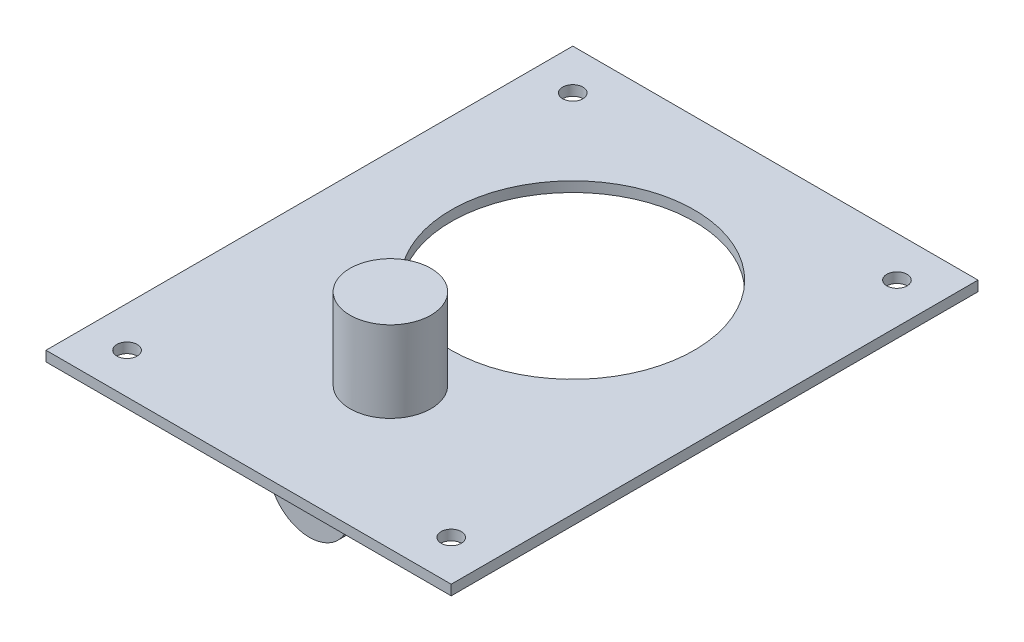
ISO-10303-21;
HEADER;
FILE_DESCRIPTION(('STEP AP214'),'2;1');
FILE_NAME('part.step','',(''),(''),'','','');
FILE_SCHEMA(('AUTOMOTIVE_DESIGN { 1 0 10303 214 1 1 1 1 }'));
ENDSEC;
DATA;
#1=APPLICATION_CONTEXT('core data for automotive mechanical design processes');
#2=APPLICATION_PROTOCOL_DEFINITION('international standard','automotive_design',2000,#1);
#3=PRODUCT_CONTEXT('',#1,'mechanical');
#4=PRODUCT('Part','Part','',(#3));
#5=PRODUCT_RELATED_PRODUCT_CATEGORY('part','',(#4));
#6=PRODUCT_DEFINITION_FORMATION('','',#4);
#7=PRODUCT_DEFINITION_CONTEXT('part definition',#1,'design');
#8=PRODUCT_DEFINITION('design','',#6,#7);
#9=PRODUCT_DEFINITION_SHAPE('','',#8);
#10=(LENGTH_UNIT() NAMED_UNIT(*) SI_UNIT(.MILLI.,.METRE.));
#11=(NAMED_UNIT(*) PLANE_ANGLE_UNIT() SI_UNIT($,.RADIAN.));
#12=(NAMED_UNIT(*) SI_UNIT($,.STERADIAN.) SOLID_ANGLE_UNIT());
#13=UNCERTAINTY_MEASURE_WITH_UNIT(LENGTH_MEASURE(1.E-05),#10,'distance_accuracy_value','');
#14=(GEOMETRIC_REPRESENTATION_CONTEXT(3) GLOBAL_UNCERTAINTY_ASSIGNED_CONTEXT((#13)) GLOBAL_UNIT_ASSIGNED_CONTEXT((#10,
#11,#12)) REPRESENTATION_CONTEXT('',''));
#15=CARTESIAN_POINT('',(0.,0.,0.));
#16=DIRECTION('',(0.,0.,1.));
#17=DIRECTION('',(1.,0.,0.));
#18=AXIS2_PLACEMENT_3D('',#15,#16,#17);
#19=CARTESIAN_POINT('',(0.,-28.575,165.1));
#20=DIRECTION('',(0.,0.,-1.));
#21=DIRECTION('',(-1.,0.,0.));
#22=AXIS2_PLACEMENT_3D('',#19,#20,#21);
#23=CYLINDRICAL_SURFACE('',#22,25.4);
#24=CARTESIAN_POINT('',(0.,-28.575,165.1));
#25=DIRECTION('',(0.,0.,1.));
#26=DIRECTION('',(1.,0.,0.));
#27=AXIS2_PLACEMENT_3D('',#24,#25,#26);
#28=CIRCLE('',#27,25.4);
#29=CARTESIAN_POINT('',(25.4,-28.575,165.1));
#30=VERTEX_POINT('',#29);
#31=EDGE_CURVE('E11',#30,#30,#28,.T.);
#32=ORIENTED_EDGE('',*,*,#31,.F.);
#33=EDGE_LOOP('',(#32));
#34=FACE_BOUND('',#33,.T.);
#35=CARTESIAN_POINT('',(0.,-28.575,114.3));
#36=DIRECTION('',(0.,0.,1.));
#37=DIRECTION('',(1.,0.,0.));
#38=AXIS2_PLACEMENT_3D('',#35,#36,#37);
#39=CIRCLE('',#38,25.4);
#40=CARTESIAN_POINT('',(25.4,-28.575,114.3));
#41=VERTEX_POINT('',#40);
#42=EDGE_CURVE('E48',#41,#41,#39,.T.);
#43=ORIENTED_EDGE('',*,*,#42,.T.);
#44=EDGE_LOOP('',(#43));
#45=FACE_BOUND('',#44,.T.);
#46=ADVANCED_FACE('F45',(#34,#45),#23,.T.);
#47=CARTESIAN_POINT('',(0.,-28.575,165.1));
#48=DIRECTION('',(0.,0.,1.));
#49=DIRECTION('',(1.,0.,0.));
#50=AXIS2_PLACEMENT_3D('',#47,#48,#49);
#51=PLANE('',#50);
#52=ORIENTED_EDGE('',*,*,#31,.T.);
#53=EDGE_LOOP('',(#52));
#54=FACE_BOUND('',#53,.T.);
#55=ADVANCED_FACE('F60',(#54),#51,.T.);
#56=CARTESIAN_POINT('',(0.,-28.575,114.3));
#57=DIRECTION('',(0.,0.,1.));
#58=DIRECTION('',(1.,0.,0.));
#59=AXIS2_PLACEMENT_3D('',#56,#57,#58);
#60=PLANE('',#59);
#61=ORIENTED_EDGE('',*,*,#42,.F.);
#62=EDGE_LOOP('',(#61));
#63=FACE_BOUND('',#62,.T.);
#64=ADVANCED_FACE('F58',(#63),#60,.F.);
#65=CLOSED_SHELL('',(#46,#55,#64));
#66=MANIFOLD_SOLID_BREP('B2',#65);
#67=CARTESIAN_POINT('',(0.,3.175,0.));
#68=DIRECTION('',(0.,-1.,0.));
#69=DIRECTION('',(0.,0.,-1.));
#70=AXIS2_PLACEMENT_3D('',#67,#68,#69);
#71=PLANE('',#70);
#72=CARTESIAN_POINT('',(101.6,3.175,-101.6));
#73=DIRECTION('',(0.,-1.,0.));
#74=DIRECTION('',(0.,0.,1.));
#75=AXIS2_PLACEMENT_3D('',#72,#73,#74);
#76=CIRCLE('',#75,6.34999999999999);
#77=CARTESIAN_POINT('',(101.6,3.175,-95.25));
#78=VERTEX_POINT('',#77);
#79=EDGE_CURVE('E199',#78,#78,#76,.T.);
#80=ORIENTED_EDGE('',*,*,#79,.T.);
#81=EDGE_LOOP('',(#80));
#82=FACE_BOUND('',#81,.T.);
#83=CARTESIAN_POINT('',(101.6,3.175,177.8));
#84=DIRECTION('',(0.,-1.,0.));
#85=DIRECTION('',(0.,0.,1.));
#86=AXIS2_PLACEMENT_3D('',#83,#84,#85);
#87=CIRCLE('',#86,6.34999999999999);
#88=CARTESIAN_POINT('',(101.6,3.175,184.15));
#89=VERTEX_POINT('',#88);
#90=EDGE_CURVE('E193',#89,#89,#87,.T.);
#91=ORIENTED_EDGE('',*,*,#90,.T.);
#92=EDGE_LOOP('',(#91));
#93=FACE_BOUND('',#92,.T.);
#94=CARTESIAN_POINT('',(-101.6,3.175,-101.6));
#95=DIRECTION('',(0.,1.,0.));
#96=DIRECTION('',(0.,0.,1.));
#97=AXIS2_PLACEMENT_3D('',#94,#95,#96);
#98=CIRCLE('',#97,6.34999999999999);
#99=CARTESIAN_POINT('',(-101.6,3.175,-95.25));
#100=VERTEX_POINT('',#99);
#101=EDGE_CURVE('E188',#100,#100,#98,.T.);
#102=ORIENTED_EDGE('',*,*,#101,.F.);
#103=EDGE_LOOP('',(#102));
#104=FACE_BOUND('',#103,.T.);
#105=CARTESIAN_POINT('',(-101.6,3.175,177.8));
#106=DIRECTION('',(0.,1.,0.));
#107=DIRECTION('',(0.,0.,1.));
#108=AXIS2_PLACEMENT_3D('',#105,#106,#107);
#109=CIRCLE('',#108,6.34999999999999);
#110=CARTESIAN_POINT('',(-101.6,3.175,184.15));
#111=VERTEX_POINT('',#110);
#112=EDGE_CURVE('E181',#111,#111,#109,.T.);
#113=ORIENTED_EDGE('',*,*,#112,.F.);
#114=EDGE_LOOP('',(#113));
#115=FACE_BOUND('',#114,.T.);
#116=CARTESIAN_POINT('',(0.,3.175,114.3));
#117=DIRECTION('',(0.,-1.,0.));
#118=DIRECTION('',(0.,0.,-1.));
#119=AXIS2_PLACEMENT_3D('',#116,#117,#118);
#120=CIRCLE('',#119,25.4);
#121=CARTESIAN_POINT('',(0.,3.175,88.9));
#122=VERTEX_POINT('',#121);
#123=EDGE_CURVE('E43',#122,#122,#120,.F.);
#124=ORIENTED_EDGE('',*,*,#123,.F.);
#125=EDGE_LOOP('',(#124));
#126=FACE_BOUND('',#125,.T.);
#127=DIRECTION('',(0.,0.,-1.));
#128=VECTOR('',#127,1.);
#129=CARTESIAN_POINT('',(127.,3.175,127.));
#130=LINE('',#129,#128);
#131=CARTESIAN_POINT('',(127.,3.175,203.2));
#132=VERTEX_POINT('',#131);
#133=CARTESIAN_POINT('',(127.,3.175,-127.));
#134=VERTEX_POINT('',#133);
#135=EDGE_CURVE('E103',#132,#134,#130,.T.);
#136=ORIENTED_EDGE('',*,*,#135,.T.);
#137=DIRECTION('',(-1.,0.,0.));
#138=VECTOR('',#137,1.);
#139=CARTESIAN_POINT('',(-127.,3.175,-127.));
#140=LINE('',#139,#138);
#141=CARTESIAN_POINT('',(-127.,3.175,-127.));
#142=VERTEX_POINT('',#141);
#143=EDGE_CURVE('E134',#134,#142,#140,.T.);
#144=ORIENTED_EDGE('',*,*,#143,.T.);
#145=DIRECTION('',(0.,0.,1.));
#146=VECTOR('',#145,1.);
#147=CARTESIAN_POINT('',(-127.,3.175,127.));
#148=LINE('',#147,#146);
#149=CARTESIAN_POINT('',(-127.,3.175,203.2));
#150=VERTEX_POINT('',#149);
#151=EDGE_CURVE('E138',#142,#150,#148,.T.);
#152=ORIENTED_EDGE('',*,*,#151,.T.);
#153=DIRECTION('',(1.,0.,0.));
#154=VECTOR('',#153,1.);
#155=CARTESIAN_POINT('',(-127.,3.175,203.2));
#156=LINE('',#155,#154);
#157=EDGE_CURVE('E148',#150,#132,#156,.T.);
#158=ORIENTED_EDGE('',*,*,#157,.T.);
#159=EDGE_LOOP('',(#136,#144,#152,#158));
#160=FACE_BOUND('',#159,.T.);
#161=CARTESIAN_POINT('',(0.,3.175,0.));
#162=DIRECTION('',(0.,1.,0.));
#163=DIRECTION('',(0.,0.,1.));
#164=AXIS2_PLACEMENT_3D('',#161,#162,#163);
#165=CIRCLE('',#164,76.2);
#166=CARTESIAN_POINT('',(0.,3.175,76.2));
#167=VERTEX_POINT('',#166);
#168=EDGE_CURVE('E155',#167,#167,#165,.T.);
#169=ORIENTED_EDGE('',*,*,#168,.F.);
#170=EDGE_LOOP('',(#169));
#171=FACE_BOUND('',#170,.T.);
#172=ADVANCED_FACE('F86',(#82,#93,#104,#115,#126,#160,#171),#71,.F.);
#173=CARTESIAN_POINT('',(0.,-3.175,0.));
#174=DIRECTION('',(0.,-1.,0.));
#175=DIRECTION('',(0.,0.,-1.));
#176=AXIS2_PLACEMENT_3D('',#173,#174,#175);
#177=PLANE('',#176);
#178=CARTESIAN_POINT('',(101.6,-3.175,-101.6));
#179=DIRECTION('',(0.,-1.,0.));
#180=DIRECTION('',(0.,0.,1.));
#181=AXIS2_PLACEMENT_3D('',#178,#179,#180);
#182=CIRCLE('',#181,6.34999999999999);
#183=CARTESIAN_POINT('',(101.6,-3.175,-95.25));
#184=VERTEX_POINT('',#183);
#185=EDGE_CURVE('E185',#184,#184,#182,.T.);
#186=ORIENTED_EDGE('',*,*,#185,.F.);
#187=EDGE_LOOP('',(#186));
#188=FACE_BOUND('',#187,.T.);
#189=CARTESIAN_POINT('',(101.6,-3.175,177.8));
#190=DIRECTION('',(0.,-1.,0.));
#191=DIRECTION('',(0.,0.,1.));
#192=AXIS2_PLACEMENT_3D('',#189,#190,#191);
#193=CIRCLE('',#192,6.34999999999999);
#194=CARTESIAN_POINT('',(101.6,-3.175,184.15));
#195=VERTEX_POINT('',#194);
#196=EDGE_CURVE('E196',#195,#195,#193,.T.);
#197=ORIENTED_EDGE('',*,*,#196,.F.);
#198=EDGE_LOOP('',(#197));
#199=FACE_BOUND('',#198,.T.);
#200=CARTESIAN_POINT('',(-101.6,-3.175,-101.6));
#201=DIRECTION('',(0.,1.,0.));
#202=DIRECTION('',(0.,0.,1.));
#203=AXIS2_PLACEMENT_3D('',#200,#201,#202);
#204=CIRCLE('',#203,6.34999999999999);
#205=CARTESIAN_POINT('',(-101.6,-3.175,-95.25));
#206=VERTEX_POINT('',#205);
#207=EDGE_CURVE('E178',#206,#206,#204,.T.);
#208=ORIENTED_EDGE('',*,*,#207,.T.);
#209=EDGE_LOOP('',(#208));
#210=FACE_BOUND('',#209,.T.);
#211=CARTESIAN_POINT('',(-101.6,-3.175,177.8));
#212=DIRECTION('',(0.,1.,0.));
#213=DIRECTION('',(0.,0.,1.));
#214=AXIS2_PLACEMENT_3D('',#211,#212,#213);
#215=CIRCLE('',#214,6.34999999999999);
#216=CARTESIAN_POINT('',(-101.6,-3.175,184.15));
#217=VERTEX_POINT('',#216);
#218=EDGE_CURVE('E184',#217,#217,#215,.T.);
#219=ORIENTED_EDGE('',*,*,#218,.T.);
#220=EDGE_LOOP('',(#219));
#221=FACE_BOUND('',#220,.T.);
#222=DIRECTION('',(-1.,0.,0.));
#223=VECTOR('',#222,1.);
#224=CARTESIAN_POINT('',(-127.,-3.175,-127.));
#225=LINE('',#224,#223);
#226=CARTESIAN_POINT('',(127.,-3.175,-127.));
#227=VERTEX_POINT('',#226);
#228=CARTESIAN_POINT('',(-127.,-3.175,-127.));
#229=VERTEX_POINT('',#228);
#230=EDGE_CURVE('E143',#227,#229,#225,.T.);
#231=ORIENTED_EDGE('',*,*,#230,.F.);
#232=DIRECTION('',(0.,0.,-1.));
#233=VECTOR('',#232,1.);
#234=CARTESIAN_POINT('',(127.,-3.175,127.));
#235=LINE('',#234,#233);
#236=CARTESIAN_POINT('',(127.,-3.175,203.2));
#237=VERTEX_POINT('',#236);
#238=EDGE_CURVE('E158',#237,#227,#235,.T.);
#239=ORIENTED_EDGE('',*,*,#238,.F.);
#240=DIRECTION('',(1.,0.,0.));
#241=VECTOR('',#240,1.);
#242=CARTESIAN_POINT('',(-127.,-3.175,203.2));
#243=LINE('',#242,#241);
#244=CARTESIAN_POINT('',(-127.,-3.175,203.2));
#245=VERTEX_POINT('',#244);
#246=EDGE_CURVE('E127',#245,#237,#243,.T.);
#247=ORIENTED_EDGE('',*,*,#246,.F.);
#248=DIRECTION('',(0.,0.,1.));
#249=VECTOR('',#248,1.);
#250=CARTESIAN_POINT('',(-127.,-3.175,127.));
#251=LINE('',#250,#249);
#252=EDGE_CURVE('E120',#229,#245,#251,.T.);
#253=ORIENTED_EDGE('',*,*,#252,.F.);
#254=EDGE_LOOP('',(#231,#239,#247,#253));
#255=FACE_BOUND('',#254,.T.);
#256=CARTESIAN_POINT('',(0.,-3.175,0.));
#257=DIRECTION('',(0.,1.,0.));
#258=DIRECTION('',(0.,0.,1.));
#259=AXIS2_PLACEMENT_3D('',#256,#257,#258);
#260=CIRCLE('',#259,76.2);
#261=CARTESIAN_POINT('',(0.,-3.175,76.2));
#262=VERTEX_POINT('',#261);
#263=EDGE_CURVE('E171',#262,#262,#260,.T.);
#264=ORIENTED_EDGE('',*,*,#263,.T.);
#265=EDGE_LOOP('',(#264));
#266=FACE_BOUND('',#265,.T.);
#267=ADVANCED_FACE('F164',(#188,#199,#210,#221,#255,#266),#177,.T.);
#268=CARTESIAN_POINT('',(-127.,3.175,-127.));
#269=DIRECTION('',(0.,0.,1.));
#270=DIRECTION('',(1.,0.,0.));
#271=AXIS2_PLACEMENT_3D('',#268,#269,#270);
#272=PLANE('',#271);
#273=ORIENTED_EDGE('',*,*,#230,.T.);
#274=DIRECTION('',(0.,-1.,0.));
#275=VECTOR('',#274,1.);
#276=CARTESIAN_POINT('',(-127.,3.175,-127.));
#277=LINE('',#276,#275);
#278=EDGE_CURVE('E141',#142,#229,#277,.T.);
#279=ORIENTED_EDGE('',*,*,#278,.F.);
#280=ORIENTED_EDGE('',*,*,#143,.F.);
#281=DIRECTION('',(0.,-1.,0.));
#282=VECTOR('',#281,1.);
#283=CARTESIAN_POINT('',(127.,3.175,-127.));
#284=LINE('',#283,#282);
#285=EDGE_CURVE('E95',#134,#227,#284,.T.);
#286=ORIENTED_EDGE('',*,*,#285,.T.);
#287=EDGE_LOOP('',(#273,#279,#280,#286));
#288=FACE_BOUND('',#287,.T.);
#289=ADVANCED_FACE('F88',(#288),#272,.F.);
#290=CARTESIAN_POINT('',(-127.,3.175,127.));
#291=DIRECTION('',(1.,0.,0.));
#292=DIRECTION('',(0.,0.,-1.));
#293=AXIS2_PLACEMENT_3D('',#290,#291,#292);
#294=PLANE('',#293);
#295=ORIENTED_EDGE('',*,*,#252,.T.);
#296=DIRECTION('',(0.,-1.,0.));
#297=VECTOR('',#296,1.);
#298=CARTESIAN_POINT('',(-127.,3.175,203.2));
#299=LINE('',#298,#297);
#300=EDGE_CURVE('E144',#150,#245,#299,.T.);
#301=ORIENTED_EDGE('',*,*,#300,.F.);
#302=ORIENTED_EDGE('',*,*,#151,.F.);
#303=ORIENTED_EDGE('',*,*,#278,.T.);
#304=EDGE_LOOP('',(#295,#301,#302,#303));
#305=FACE_BOUND('',#304,.T.);
#306=ADVANCED_FACE('F146',(#305),#294,.F.);
#307=CARTESIAN_POINT('',(-127.,3.175,203.2));
#308=DIRECTION('',(0.,0.,-1.));
#309=DIRECTION('',(-1.,0.,0.));
#310=AXIS2_PLACEMENT_3D('',#307,#308,#309);
#311=PLANE('',#310);
#312=ORIENTED_EDGE('',*,*,#246,.T.);
#313=DIRECTION('',(0.,-1.,0.));
#314=VECTOR('',#313,1.);
#315=CARTESIAN_POINT('',(127.,3.175,203.2));
#316=LINE('',#315,#314);
#317=EDGE_CURVE('E150',#132,#237,#316,.T.);
#318=ORIENTED_EDGE('',*,*,#317,.F.);
#319=ORIENTED_EDGE('',*,*,#157,.F.);
#320=ORIENTED_EDGE('',*,*,#300,.T.);
#321=EDGE_LOOP('',(#312,#318,#319,#320));
#322=FACE_BOUND('',#321,.T.);
#323=ADVANCED_FACE('F245',(#322),#311,.F.);
#324=CARTESIAN_POINT('',(127.,3.175,127.));
#325=DIRECTION('',(-1.,0.,0.));
#326=DIRECTION('',(0.,0.,1.));
#327=AXIS2_PLACEMENT_3D('',#324,#325,#326);
#328=PLANE('',#327);
#329=ORIENTED_EDGE('',*,*,#238,.T.);
#330=ORIENTED_EDGE('',*,*,#285,.F.);
#331=ORIENTED_EDGE('',*,*,#135,.F.);
#332=ORIENTED_EDGE('',*,*,#317,.T.);
#333=EDGE_LOOP('',(#329,#330,#331,#332));
#334=FACE_BOUND('',#333,.T.);
#335=ADVANCED_FACE('F161',(#334),#328,.F.);
#336=CARTESIAN_POINT('',(0.,3.175,0.));
#337=DIRECTION('',(0.,-1.,0.));
#338=DIRECTION('',(0.,0.,-1.));
#339=AXIS2_PLACEMENT_3D('',#336,#337,#338);
#340=CYLINDRICAL_SURFACE('',#339,76.2);
#341=ORIENTED_EDGE('',*,*,#168,.T.);
#342=EDGE_LOOP('',(#341));
#343=FACE_BOUND('',#342,.T.);
#344=ORIENTED_EDGE('',*,*,#263,.F.);
#345=EDGE_LOOP('',(#344));
#346=FACE_BOUND('',#345,.T.);
#347=ADVANCED_FACE('F230',(#343,#346),#340,.F.);
#348=CARTESIAN_POINT('',(0.,53.975,114.3));
#349=DIRECTION('',(0.,-1.,0.));
#350=DIRECTION('',(0.,0.,-1.));
#351=AXIS2_PLACEMENT_3D('',#348,#349,#350);
#352=CYLINDRICAL_SURFACE('',#351,25.4);
#353=CARTESIAN_POINT('',(0.,53.975,114.3));
#354=DIRECTION('',(0.,1.,0.));
#355=DIRECTION('',(0.,0.,1.));
#356=AXIS2_PLACEMENT_3D('',#353,#354,#355);
#357=CIRCLE('',#356,25.4);
#358=CARTESIAN_POINT('',(0.,53.975,139.7));
#359=VERTEX_POINT('',#358);
#360=EDGE_CURVE('E173',#359,#359,#357,.T.);
#361=ORIENTED_EDGE('',*,*,#360,.F.);
#362=EDGE_LOOP('',(#361));
#363=FACE_BOUND('',#362,.T.);
#364=ORIENTED_EDGE('',*,*,#123,.T.);
#365=EDGE_LOOP('',(#364));
#366=FACE_BOUND('',#365,.T.);
#367=ADVANCED_FACE('F228',(#363,#366),#352,.T.);
#368=CARTESIAN_POINT('',(0.,53.975,114.3));
#369=DIRECTION('',(0.,1.,0.));
#370=DIRECTION('',(0.,0.,1.));
#371=AXIS2_PLACEMENT_3D('',#368,#369,#370);
#372=PLANE('',#371);
#373=ORIENTED_EDGE('',*,*,#360,.T.);
#374=EDGE_LOOP('',(#373));
#375=FACE_BOUND('',#374,.T.);
#376=ADVANCED_FACE('F218',(#375),#372,.T.);
#377=CARTESIAN_POINT('',(-101.6,-3.175,177.8));
#378=DIRECTION('',(0.,1.,0.));
#379=DIRECTION('',(0.,0.,1.));
#380=AXIS2_PLACEMENT_3D('',#377,#378,#379);
#381=CYLINDRICAL_SURFACE('',#380,6.34999999999999);
#382=ORIENTED_EDGE('',*,*,#218,.F.);
#383=EDGE_LOOP('',(#382));
#384=FACE_BOUND('',#383,.T.);
#385=ORIENTED_EDGE('',*,*,#112,.T.);
#386=EDGE_LOOP('',(#385));
#387=FACE_BOUND('',#386,.T.);
#388=ADVANCED_FACE('F214',(#384,#387),#381,.F.);
#389=CARTESIAN_POINT('',(-101.6,-3.175,-101.6));
#390=DIRECTION('',(0.,1.,0.));
#391=DIRECTION('',(0.,0.,1.));
#392=AXIS2_PLACEMENT_3D('',#389,#390,#391);
#393=CYLINDRICAL_SURFACE('',#392,6.34999999999999);
#394=ORIENTED_EDGE('',*,*,#207,.F.);
#395=EDGE_LOOP('',(#394));
#396=FACE_BOUND('',#395,.T.);
#397=ORIENTED_EDGE('',*,*,#101,.T.);
#398=EDGE_LOOP('',(#397));
#399=FACE_BOUND('',#398,.T.);
#400=ADVANCED_FACE('F217',(#396,#399),#393,.F.);
#401=CARTESIAN_POINT('',(101.6,-3.175,177.8));
#402=DIRECTION('',(0.,1.,0.));
#403=DIRECTION('',(0.,0.,1.));
#404=AXIS2_PLACEMENT_3D('',#401,#402,#403);
#405=CYLINDRICAL_SURFACE('',#404,6.34999999999999);
#406=ORIENTED_EDGE('',*,*,#196,.T.);
#407=EDGE_LOOP('',(#406));
#408=FACE_BOUND('',#407,.T.);
#409=ORIENTED_EDGE('',*,*,#90,.F.);
#410=EDGE_LOOP('',(#409));
#411=FACE_BOUND('',#410,.T.);
#412=ADVANCED_FACE('F271',(#408,#411),#405,.F.);
#413=CARTESIAN_POINT('',(101.6,-3.175,-101.6));
#414=DIRECTION('',(0.,1.,0.));
#415=DIRECTION('',(0.,0.,1.));
#416=AXIS2_PLACEMENT_3D('',#413,#414,#415);
#417=CYLINDRICAL_SURFACE('',#416,6.34999999999999);
#418=ORIENTED_EDGE('',*,*,#185,.T.);
#419=EDGE_LOOP('',(#418));
#420=FACE_BOUND('',#419,.T.);
#421=ORIENTED_EDGE('',*,*,#79,.F.);
#422=EDGE_LOOP('',(#421));
#423=FACE_BOUND('',#422,.T.);
#424=ADVANCED_FACE('F205',(#420,#423),#417,.F.);
#425=CLOSED_SHELL('',(#172,#267,#289,#306,#323,#335,#347,#367,#376,#388,#400,#412,#424));
#426=MANIFOLD_SOLID_BREP('B6',#425);
#427=ADVANCED_BREP_SHAPE_REPRESENTATION('',(#18,#66,#426),#14);
#428=SHAPE_DEFINITION_REPRESENTATION(#9,#427);
ENDSEC;
END-ISO-10303-21;
